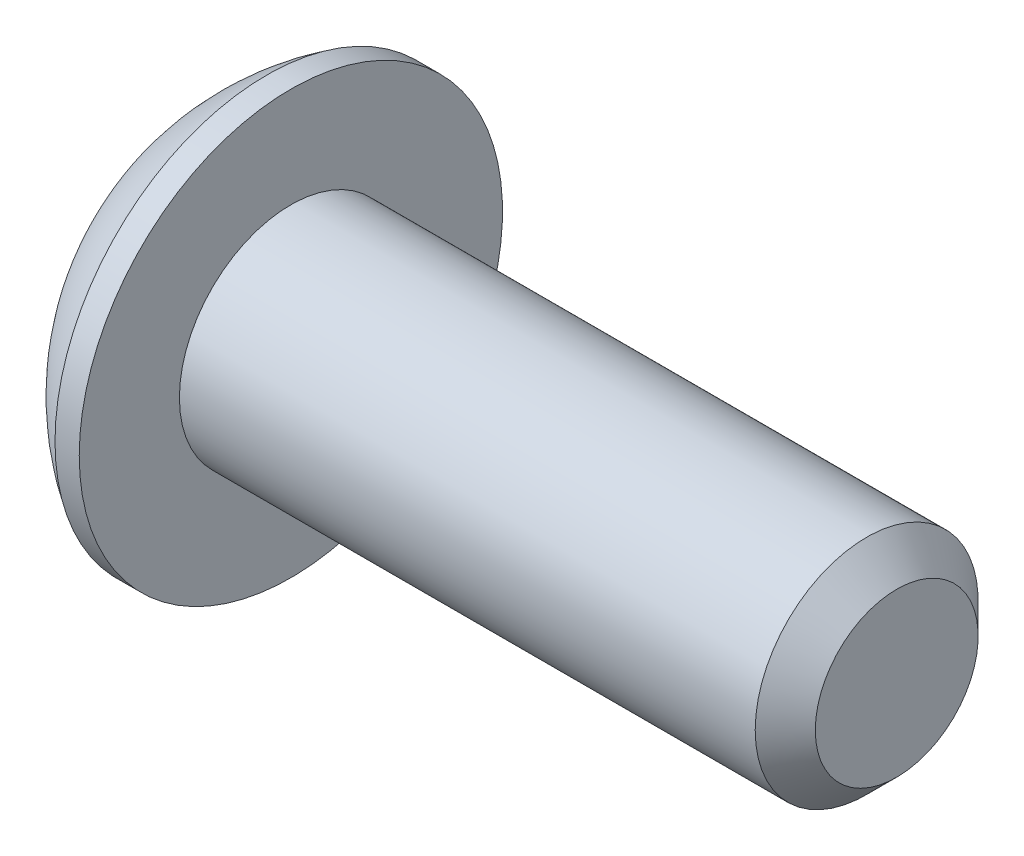
ISO-10303-21;
HEADER;
FILE_DESCRIPTION(('STEP AP214'),'2;1');
FILE_NAME('part.step','',(''),(''),'','','');
FILE_SCHEMA(('AUTOMOTIVE_DESIGN { 1 0 10303 214 1 1 1 1 }'));
ENDSEC;
DATA;
#1=APPLICATION_CONTEXT('core data for automotive mechanical design processes');
#2=APPLICATION_PROTOCOL_DEFINITION('international standard','automotive_design',2000,#1);
#3=PRODUCT_CONTEXT('',#1,'mechanical');
#4=PRODUCT('Part','Part','',(#3));
#5=PRODUCT_RELATED_PRODUCT_CATEGORY('part','',(#4));
#6=PRODUCT_DEFINITION_FORMATION('','',#4);
#7=PRODUCT_DEFINITION_CONTEXT('part definition',#1,'design');
#8=PRODUCT_DEFINITION('design','',#6,#7);
#9=PRODUCT_DEFINITION_SHAPE('','',#8);
#10=(LENGTH_UNIT() NAMED_UNIT(*) SI_UNIT(.MILLI.,.METRE.));
#11=(NAMED_UNIT(*) PLANE_ANGLE_UNIT() SI_UNIT($,.RADIAN.));
#12=(NAMED_UNIT(*) SI_UNIT($,.STERADIAN.) SOLID_ANGLE_UNIT());
#13=UNCERTAINTY_MEASURE_WITH_UNIT(LENGTH_MEASURE(1.E-05),#10,'distance_accuracy_value','');
#14=(GEOMETRIC_REPRESENTATION_CONTEXT(3) GLOBAL_UNCERTAINTY_ASSIGNED_CONTEXT((#13)) GLOBAL_UNIT_ASSIGNED_CONTEXT((#10,
#11,#12)) REPRESENTATION_CONTEXT('',''));
#15=CARTESIAN_POINT('',(0.,0.,0.));
#16=DIRECTION('',(0.,0.,1.));
#17=DIRECTION('',(1.,0.,0.));
#18=AXIS2_PLACEMENT_3D('',#15,#16,#17);
#19=CARTESIAN_POINT('',(0.,0.,0.));
#20=DIRECTION('',(-1.,0.,0.));
#21=DIRECTION('',(0.,0.,1.));
#22=AXIS2_PLACEMENT_3D('',#19,#20,#21);
#23=PLANE('',#22);
#24=CARTESIAN_POINT('',(0.,0.,0.));
#25=DIRECTION('',(-1.,0.,0.));
#26=DIRECTION('',(0.,0.,1.));
#27=AXIS2_PLACEMENT_3D('',#24,#25,#26);
#28=CIRCLE('',#27,1.6637);
#29=CARTESIAN_POINT('',(0.,0.,1.6637));
#30=VERTEX_POINT('',#29);
#31=EDGE_CURVE('E10',#30,#30,#28,.T.);
#32=ORIENTED_EDGE('',*,*,#31,.T.);
#33=EDGE_LOOP('',(#32));
#34=FACE_BOUND('',#33,.T.);
#35=DIRECTION('',(0.,1.,0.));
#36=VECTOR('',#35,1.);
#37=CARTESIAN_POINT('',(0.,0.571923176659244,-0.9906));
#38=LINE('',#37,#36);
#39=CARTESIAN_POINT('',(0.,-0.571923176659242,-0.9906));
#40=VERTEX_POINT('',#39);
#41=CARTESIAN_POINT('',(0.,0.571923176659244,-0.9906));
#42=VERTEX_POINT('',#41);
#43=EDGE_CURVE('E212',#40,#42,#38,.T.);
#44=ORIENTED_EDGE('',*,*,#43,.T.);
#45=DIRECTION('',(0.,0.5,0.866025403784439));
#46=VECTOR('',#45,1.);
#47=CARTESIAN_POINT('',(0.,1.14384635331849,0.));
#48=LINE('',#47,#46);
#49=CARTESIAN_POINT('',(0.,1.14384635331849,0.));
#50=VERTEX_POINT('',#49);
#51=EDGE_CURVE('E215',#42,#50,#48,.T.);
#52=ORIENTED_EDGE('',*,*,#51,.T.);
#53=DIRECTION('',(0.,-0.5,0.866025403784439));
#54=VECTOR('',#53,1.);
#55=CARTESIAN_POINT('',(0.,0.571923176659244,0.990600000000001));
#56=LINE('',#55,#54);
#57=CARTESIAN_POINT('',(0.,0.571923176659244,0.990600000000001));
#58=VERTEX_POINT('',#57);
#59=EDGE_CURVE('E194',#50,#58,#56,.T.);
#60=ORIENTED_EDGE('',*,*,#59,.T.);
#61=DIRECTION('',(0.,-1.,0.));
#62=VECTOR('',#61,1.);
#63=CARTESIAN_POINT('',(0.,-0.571923176659243,0.9906));
#64=LINE('',#63,#62);
#65=CARTESIAN_POINT('',(0.,-0.571923176659243,0.9906));
#66=VERTEX_POINT('',#65);
#67=EDGE_CURVE('E182',#58,#66,#64,.T.);
#68=ORIENTED_EDGE('',*,*,#67,.T.);
#69=DIRECTION('',(0.,-0.499999999999999,-0.866025403784439));
#70=VECTOR('',#69,1.);
#71=CARTESIAN_POINT('',(0.,-1.14384635331848,0.));
#72=LINE('',#71,#70);
#73=CARTESIAN_POINT('',(0.,-1.14384635331848,0.));
#74=VERTEX_POINT('',#73);
#75=EDGE_CURVE('E127',#66,#74,#72,.T.);
#76=ORIENTED_EDGE('',*,*,#75,.T.);
#77=DIRECTION('',(0.,0.499999999999999,-0.866025403784439));
#78=VECTOR('',#77,1.);
#79=CARTESIAN_POINT('',(0.,-0.571923176659242,-0.9906));
#80=LINE('',#79,#78);
#81=EDGE_CURVE('E35',#74,#40,#80,.T.);
#82=ORIENTED_EDGE('',*,*,#81,.T.);
#83=EDGE_LOOP('',(#44,#52,#60,#68,#76,#82));
#84=FACE_BOUND('',#83,.T.);
#85=ADVANCED_FACE('F16',(#34,#84),#23,.T.);
#86=CARTESIAN_POINT('',(3.55485043103449,0.,0.));
#87=DIRECTION('',(-1.,0.,0.));
#88=DIRECTION('',(0.,1.,0.));
#89=AXIS2_PLACEMENT_3D('',#86,#87,#88);
#90=SPHERICAL_SURFACE('',#89,3.92490245446);
#91=CARTESIAN_POINT('',(1.4732,0.,0.));
#92=DIRECTION('',(-1.,0.,0.));
#93=DIRECTION('',(0.,0.,1.));
#94=AXIS2_PLACEMENT_3D('',#91,#92,#93);
#95=CIRCLE('',#94,3.3274);
#96=CARTESIAN_POINT('',(1.4732,0.,3.3274));
#97=VERTEX_POINT('',#96);
#98=EDGE_CURVE('E24',#97,#97,#95,.T.);
#99=ORIENTED_EDGE('',*,*,#98,.T.);
#100=EDGE_LOOP('',(#99));
#101=FACE_BOUND('',#100,.T.);
#102=ORIENTED_EDGE('',*,*,#31,.F.);
#103=EDGE_LOOP('',(#102));
#104=FACE_BOUND('',#103,.T.);
#105=ADVANCED_FACE('F240',(#101,#104),#90,.T.);
#106=CARTESIAN_POINT('',(0.,0.,0.));
#107=DIRECTION('',(-1.,0.,0.));
#108=DIRECTION('',(0.,0.,1.));
#109=AXIS2_PLACEMENT_3D('',#106,#107,#108);
#110=CYLINDRICAL_SURFACE('',#109,3.3274);
#111=ORIENTED_EDGE('',*,*,#98,.F.);
#112=EDGE_LOOP('',(#111));
#113=FACE_BOUND('',#112,.T.);
#114=CARTESIAN_POINT('',(1.8542,0.,0.));
#115=DIRECTION('',(-1.,0.,0.));
#116=DIRECTION('',(0.,0.,1.));
#117=AXIS2_PLACEMENT_3D('',#114,#115,#116);
#118=CIRCLE('',#117,3.3274);
#119=CARTESIAN_POINT('',(1.8542,0.,3.3274));
#120=VERTEX_POINT('',#119);
#121=EDGE_CURVE('E231',#120,#120,#118,.T.);
#122=ORIENTED_EDGE('',*,*,#121,.T.);
#123=EDGE_LOOP('',(#122));
#124=FACE_BOUND('',#123,.T.);
#125=ADVANCED_FACE('F243',(#113,#124),#110,.T.);
#126=CARTESIAN_POINT('',(1.8542,1.7526,0.));
#127=DIRECTION('',(-1.,0.,0.));
#128=DIRECTION('',(0.,0.,1.));
#129=AXIS2_PLACEMENT_3D('',#126,#127,#128);
#130=PLANE('',#129);
#131=ORIENTED_EDGE('',*,*,#121,.F.);
#132=EDGE_LOOP('',(#131));
#133=FACE_BOUND('',#132,.T.);
#134=CARTESIAN_POINT('',(1.8542,0.,0.));
#135=DIRECTION('',(-1.,0.,0.));
#136=DIRECTION('',(0.,0.,1.));
#137=AXIS2_PLACEMENT_3D('',#134,#135,#136);
#138=CIRCLE('',#137,1.7526);
#139=CARTESIAN_POINT('',(1.8542,0.,1.7526));
#140=VERTEX_POINT('',#139);
#141=EDGE_CURVE('E227',#140,#140,#138,.T.);
#142=ORIENTED_EDGE('',*,*,#141,.T.);
#143=EDGE_LOOP('',(#142));
#144=FACE_BOUND('',#143,.T.);
#145=ADVANCED_FACE('F246',(#133,#144),#130,.F.);
#146=CARTESIAN_POINT('',(0.,0.,0.));
#147=DIRECTION('',(-1.,0.,0.));
#148=DIRECTION('',(0.,0.,1.));
#149=AXIS2_PLACEMENT_3D('',#146,#147,#148);
#150=CYLINDRICAL_SURFACE('',#149,1.7526);
#151=ORIENTED_EDGE('',*,*,#141,.F.);
#152=EDGE_LOOP('',(#151));
#153=FACE_BOUND('',#152,.T.);
#154=CARTESIAN_POINT('',(10.90676,0.,0.));
#155=DIRECTION('',(-1.,0.,0.));
#156=DIRECTION('',(0.,0.,1.));
#157=AXIS2_PLACEMENT_3D('',#154,#155,#156);
#158=CIRCLE('',#157,1.7526);
#159=CARTESIAN_POINT('',(10.90676,0.,1.7526));
#160=VERTEX_POINT('',#159);
#161=EDGE_CURVE('E223',#160,#160,#158,.T.);
#162=ORIENTED_EDGE('',*,*,#161,.T.);
#163=EDGE_LOOP('',(#162));
#164=FACE_BOUND('',#163,.T.);
#165=ADVANCED_FACE('F252',(#153,#164),#150,.T.);
#166=CARTESIAN_POINT('',(11.3792,0.,0.));
#167=DIRECTION('',(-1.,0.,0.));
#168=DIRECTION('',(0.,0.,1.));
#169=AXIS2_PLACEMENT_3D('',#166,#167,#168);
#170=CONICAL_SURFACE('',#169,1.28016,0.78539816339748);
#171=ORIENTED_EDGE('',*,*,#161,.F.);
#172=EDGE_LOOP('',(#171));
#173=FACE_BOUND('',#172,.T.);
#174=CARTESIAN_POINT('',(11.3792,0.,0.));
#175=DIRECTION('',(-1.,0.,0.));
#176=DIRECTION('',(0.,0.,1.));
#177=AXIS2_PLACEMENT_3D('',#174,#175,#176);
#178=CIRCLE('',#177,1.28016);
#179=CARTESIAN_POINT('',(11.3792,0.,1.28016));
#180=VERTEX_POINT('',#179);
#181=EDGE_CURVE('E219',#180,#180,#178,.T.);
#182=ORIENTED_EDGE('',*,*,#181,.T.);
#183=EDGE_LOOP('',(#182));
#184=FACE_BOUND('',#183,.T.);
#185=ADVANCED_FACE('F258',(#173,#184),#170,.T.);
#186=CARTESIAN_POINT('',(11.3792,0.,0.));
#187=DIRECTION('',(-1.,0.,0.));
#188=DIRECTION('',(0.,0.,1.));
#189=AXIS2_PLACEMENT_3D('',#186,#187,#188);
#190=PLANE('',#189);
#191=ORIENTED_EDGE('',*,*,#181,.F.);
#192=EDGE_LOOP('',(#191));
#193=FACE_BOUND('',#192,.T.);
#194=ADVANCED_FACE('F264',(#193),#190,.F.);
#195=CARTESIAN_POINT('',(1.1176,1.14384635331849,0.));
#196=DIRECTION('',(0.,-0.866025403784439,0.5));
#197=DIRECTION('',(0.,-0.5,-0.866025403784439));
#198=AXIS2_PLACEMENT_3D('',#195,#196,#197);
#199=PLANE('',#198);
#200=DIRECTION('',(0.,0.5,0.866025403784439));
#201=VECTOR('',#200,1.);
#202=CARTESIAN_POINT('',(1.1176,1.14384635331849,0.));
#203=LINE('',#202,#201);
#204=CARTESIAN_POINT('',(1.1176,0.571923176659244,-0.9906));
#205=VERTEX_POINT('',#204);
#206=CARTESIAN_POINT('',(1.1176,0.857884764988866,-0.495300000000001));
#207=VERTEX_POINT('',#206);
#208=EDGE_CURVE('E205',#205,#207,#203,.T.);
#209=ORIENTED_EDGE('',*,*,#208,.T.);
#210=CARTESIAN_POINT('',(1.1176,1.14384635331849,0.));
#211=VERTEX_POINT('',#210);
#212=EDGE_CURVE('E201',#207,#211,#203,.T.);
#213=ORIENTED_EDGE('',*,*,#212,.T.);
#214=DIRECTION('',(-1.,0.,0.));
#215=VECTOR('',#214,1.);
#216=CARTESIAN_POINT('',(1.1176,1.14384635331849,0.));
#217=LINE('',#216,#215);
#218=EDGE_CURVE('E197',#211,#50,#217,.T.);
#219=ORIENTED_EDGE('',*,*,#218,.T.);
#220=ORIENTED_EDGE('',*,*,#51,.F.);
#221=DIRECTION('',(-1.,0.,0.));
#222=VECTOR('',#221,1.);
#223=CARTESIAN_POINT('',(1.1176,0.571923176659244,-0.9906));
#224=LINE('',#223,#222);
#225=EDGE_CURVE('E47',#205,#42,#224,.T.);
#226=ORIENTED_EDGE('',*,*,#225,.F.);
#227=EDGE_LOOP('',(#209,#213,#219,#220,#226));
#228=FACE_BOUND('',#227,.T.);
#229=ADVANCED_FACE('F269',(#228),#199,.T.);
#230=CARTESIAN_POINT('',(1.1176,0.571923176659244,-0.9906));
#231=DIRECTION('',(0.,0.,1.));
#232=DIRECTION('',(1.,0.,0.));
#233=AXIS2_PLACEMENT_3D('',#230,#231,#232);
#234=PLANE('',#233);
#235=DIRECTION('',(0.,1.,0.));
#236=VECTOR('',#235,1.);
#237=CARTESIAN_POINT('',(1.1176,0.571923176659244,-0.9906));
#238=LINE('',#237,#236);
#239=CARTESIAN_POINT('',(1.1176,-0.571923176659242,-0.9906));
#240=VERTEX_POINT('',#239);
#241=CARTESIAN_POINT('',(1.1176,0.,-0.9906));
#242=VERTEX_POINT('',#241);
#243=EDGE_CURVE('E209',#240,#242,#238,.T.);
#244=ORIENTED_EDGE('',*,*,#243,.T.);
#245=EDGE_CURVE('E206',#242,#205,#238,.T.);
#246=ORIENTED_EDGE('',*,*,#245,.T.);
#247=ORIENTED_EDGE('',*,*,#225,.T.);
#248=ORIENTED_EDGE('',*,*,#43,.F.);
#249=DIRECTION('',(-1.,0.,0.));
#250=VECTOR('',#249,1.);
#251=CARTESIAN_POINT('',(1.1176,-0.571923176659242,-0.9906));
#252=LINE('',#251,#250);
#253=EDGE_CURVE('E171',#240,#40,#252,.T.);
#254=ORIENTED_EDGE('',*,*,#253,.F.);
#255=EDGE_LOOP('',(#244,#246,#247,#248,#254));
#256=FACE_BOUND('',#255,.T.);
#257=ADVANCED_FACE('F275',(#256),#234,.T.);
#258=CARTESIAN_POINT('',(1.1176,-1.71576952997773,-0.9906));
#259=DIRECTION('',(1.,0.,0.));
#260=DIRECTION('',(0.,0.,-1.));
#261=AXIS2_PLACEMENT_3D('',#258,#259,#260);
#262=PLANE('',#261);
#263=CARTESIAN_POINT('',(1.1176,0.,0.));
#264=DIRECTION('',(-1.,0.,0.));
#265=DIRECTION('',(0.,0.,1.));
#266=AXIS2_PLACEMENT_3D('',#263,#264,#265);
#267=CIRCLE('',#266,0.9906);
#268=CARTESIAN_POINT('',(1.1176,-0.857884764988865,-0.495299999999999));
#269=VERTEX_POINT('',#268);
#270=EDGE_CURVE('E145',#242,#269,#267,.T.);
#271=ORIENTED_EDGE('',*,*,#270,.F.);
#272=ORIENTED_EDGE('',*,*,#243,.F.);
#273=DIRECTION('',(0.,0.499999999999999,-0.866025403784439));
#274=VECTOR('',#273,1.);
#275=CARTESIAN_POINT('',(1.1176,-0.571923176659242,-0.9906));
#276=LINE('',#275,#274);
#277=EDGE_CURVE('E156',#269,#240,#276,.T.);
#278=ORIENTED_EDGE('',*,*,#277,.F.);
#279=EDGE_LOOP('',(#271,#272,#278));
#280=FACE_BOUND('',#279,.T.);
#281=ADVANCED_FACE('F289',(#280),#262,.F.);
#282=EDGE_CURVE('E170',#207,#242,#267,.T.);
#283=ORIENTED_EDGE('',*,*,#282,.F.);
#284=ORIENTED_EDGE('',*,*,#208,.F.);
#285=ORIENTED_EDGE('',*,*,#245,.F.);
#286=EDGE_LOOP('',(#283,#284,#285));
#287=FACE_BOUND('',#286,.T.);
#288=ADVANCED_FACE('F371',(#287),#262,.F.);
#289=CARTESIAN_POINT('',(1.1176,0.857884764988866,0.495300000000001));
#290=VERTEX_POINT('',#289);
#291=EDGE_CURVE('E163',#290,#207,#267,.T.);
#292=ORIENTED_EDGE('',*,*,#291,.F.);
#293=DIRECTION('',(0.,-0.5,0.866025403784439));
#294=VECTOR('',#293,1.);
#295=CARTESIAN_POINT('',(1.1176,0.571923176659244,0.990600000000001));
#296=LINE('',#295,#294);
#297=EDGE_CURVE('E193',#211,#290,#296,.T.);
#298=ORIENTED_EDGE('',*,*,#297,.F.);
#299=ORIENTED_EDGE('',*,*,#212,.F.);
#300=EDGE_LOOP('',(#292,#298,#299));
#301=FACE_BOUND('',#300,.T.);
#302=ADVANCED_FACE('F368',(#301),#262,.F.);
#303=CARTESIAN_POINT('',(1.1176,0.571923176659244,0.990600000000001));
#304=DIRECTION('',(0.,-0.866025403784439,-0.5));
#305=DIRECTION('',(0.,0.5,-0.866025403784439));
#306=AXIS2_PLACEMENT_3D('',#303,#304,#305);
#307=PLANE('',#306);
#308=ORIENTED_EDGE('',*,*,#297,.T.);
#309=CARTESIAN_POINT('',(1.1176,0.571923176659244,0.990600000000001));
#310=VERTEX_POINT('',#309);
#311=EDGE_CURVE('E190',#290,#310,#296,.T.);
#312=ORIENTED_EDGE('',*,*,#311,.T.);
#313=DIRECTION('',(-1.,0.,0.));
#314=VECTOR('',#313,1.);
#315=CARTESIAN_POINT('',(1.1176,0.571923176659244,0.990600000000001));
#316=LINE('',#315,#314);
#317=EDGE_CURVE('E186',#310,#58,#316,.T.);
#318=ORIENTED_EDGE('',*,*,#317,.T.);
#319=ORIENTED_EDGE('',*,*,#59,.F.);
#320=ORIENTED_EDGE('',*,*,#218,.F.);
#321=EDGE_LOOP('',(#308,#312,#318,#319,#320));
#322=FACE_BOUND('',#321,.T.);
#323=ADVANCED_FACE('F365',(#322),#307,.T.);
#324=CARTESIAN_POINT('',(1.1176,0.,0.9906));
#325=VERTEX_POINT('',#324);
#326=EDGE_CURVE('E151',#325,#290,#267,.T.);
#327=ORIENTED_EDGE('',*,*,#326,.F.);
#328=DIRECTION('',(0.,-1.,0.));
#329=VECTOR('',#328,1.);
#330=CARTESIAN_POINT('',(1.1176,-0.571923176659243,0.9906));
#331=LINE('',#330,#329);
#332=EDGE_CURVE('E160',#310,#325,#331,.T.);
#333=ORIENTED_EDGE('',*,*,#332,.F.);
#334=ORIENTED_EDGE('',*,*,#311,.F.);
#335=EDGE_LOOP('',(#327,#333,#334));
#336=FACE_BOUND('',#335,.T.);
#337=ADVANCED_FACE('F362',(#336),#262,.F.);
#338=CARTESIAN_POINT('',(1.1176,-0.571923176659243,0.9906));
#339=DIRECTION('',(0.,0.,-1.));
#340=DIRECTION('',(0.,1.,0.));
#341=AXIS2_PLACEMENT_3D('',#338,#339,#340);
#342=PLANE('',#341);
#343=ORIENTED_EDGE('',*,*,#332,.T.);
#344=CARTESIAN_POINT('',(1.1176,-0.571923176659243,0.9906));
#345=VERTEX_POINT('',#344);
#346=EDGE_CURVE('E140',#325,#345,#331,.T.);
#347=ORIENTED_EDGE('',*,*,#346,.T.);
#348=DIRECTION('',(-1.,0.,0.));
#349=VECTOR('',#348,1.);
#350=CARTESIAN_POINT('',(1.1176,-0.571923176659243,0.9906));
#351=LINE('',#350,#349);
#352=EDGE_CURVE('E121',#345,#66,#351,.T.);
#353=ORIENTED_EDGE('',*,*,#352,.T.);
#354=ORIENTED_EDGE('',*,*,#67,.F.);
#355=ORIENTED_EDGE('',*,*,#317,.F.);
#356=EDGE_LOOP('',(#343,#347,#353,#354,#355));
#357=FACE_BOUND('',#356,.T.);
#358=ADVANCED_FACE('F358',(#357),#342,.T.);
#359=CARTESIAN_POINT('',(1.68952317665925,0.,0.));
#360=DIRECTION('',(-1.,0.,0.));
#361=DIRECTION('',(0.,0.,1.));
#362=AXIS2_PLACEMENT_3D('',#359,#360,#361);
#363=CONICAL_SURFACE('',#362,0.,1.04719755119659);
#364=ORIENTED_EDGE('',*,*,#326,.T.);
#365=ORIENTED_EDGE('',*,*,#291,.T.);
#366=ORIENTED_EDGE('',*,*,#282,.T.);
#367=ORIENTED_EDGE('',*,*,#270,.T.);
#368=CARTESIAN_POINT('',(1.1176,-0.857884764988864,0.495299999999998));
#369=VERTEX_POINT('',#368);
#370=EDGE_CURVE('E133',#269,#369,#267,.T.);
#371=ORIENTED_EDGE('',*,*,#370,.T.);
#372=EDGE_CURVE('E138',#369,#325,#267,.T.);
#373=ORIENTED_EDGE('',*,*,#372,.T.);
#374=EDGE_LOOP('',(#364,#365,#366,#367,#371,#373));
#375=FACE_BOUND('',#374,.T.);
#376=CARTESIAN_POINT('',(1.68952317665925,0.,0.));
#377=VERTEX_POINT('',#376);
#378=VERTEX_LOOP('',#377);
#379=FACE_BOUND('',#378,.T.);
#380=ADVANCED_FACE('F147',(#375,#379),#363,.F.);
#381=CARTESIAN_POINT('',(1.1176,-0.571923176659242,-0.9906));
#382=DIRECTION('',(0.,0.866025403784439,0.499999999999999));
#383=DIRECTION('',(0.,-0.499999999999999,0.866025403784439));
#384=AXIS2_PLACEMENT_3D('',#381,#382,#383);
#385=PLANE('',#384);
#386=CARTESIAN_POINT('',(1.1176,-1.14384635331848,0.));
#387=VERTEX_POINT('',#386);
#388=EDGE_CURVE('E135',#387,#269,#276,.T.);
#389=ORIENTED_EDGE('',*,*,#388,.T.);
#390=ORIENTED_EDGE('',*,*,#277,.T.);
#391=ORIENTED_EDGE('',*,*,#253,.T.);
#392=ORIENTED_EDGE('',*,*,#81,.F.);
#393=DIRECTION('',(-1.,0.,0.));
#394=VECTOR('',#393,1.);
#395=CARTESIAN_POINT('',(1.1176,-1.14384635331848,0.));
#396=LINE('',#395,#394);
#397=EDGE_CURVE('E137',#387,#74,#396,.T.);
#398=ORIENTED_EDGE('',*,*,#397,.F.);
#399=EDGE_LOOP('',(#389,#390,#391,#392,#398));
#400=FACE_BOUND('',#399,.T.);
#401=ADVANCED_FACE('F381',(#400),#385,.T.);
#402=ORIENTED_EDGE('',*,*,#370,.F.);
#403=ORIENTED_EDGE('',*,*,#388,.F.);
#404=DIRECTION('',(0.,-0.499999999999999,-0.866025403784439));
#405=VECTOR('',#404,1.);
#406=CARTESIAN_POINT('',(1.1176,-1.14384635331848,0.));
#407=LINE('',#406,#405);
#408=EDGE_CURVE('E119',#369,#387,#407,.T.);
#409=ORIENTED_EDGE('',*,*,#408,.F.);
#410=EDGE_LOOP('',(#402,#403,#409));
#411=FACE_BOUND('',#410,.T.);
#412=ADVANCED_FACE('F131',(#411),#262,.F.);
#413=ORIENTED_EDGE('',*,*,#372,.F.);
#414=EDGE_CURVE('E116',#345,#369,#407,.T.);
#415=ORIENTED_EDGE('',*,*,#414,.F.);
#416=ORIENTED_EDGE('',*,*,#346,.F.);
#417=EDGE_LOOP('',(#413,#415,#416));
#418=FACE_BOUND('',#417,.T.);
#419=ADVANCED_FACE('F139',(#418),#262,.F.);
#420=CARTESIAN_POINT('',(1.1176,-1.14384635331848,0.));
#421=DIRECTION('',(0.,0.866025403784439,-0.499999999999999));
#422=DIRECTION('',(0.,0.499999999999999,0.866025403784439));
#423=AXIS2_PLACEMENT_3D('',#420,#421,#422);
#424=PLANE('',#423);
#425=ORIENTED_EDGE('',*,*,#414,.T.);
#426=ORIENTED_EDGE('',*,*,#408,.T.);
#427=ORIENTED_EDGE('',*,*,#397,.T.);
#428=ORIENTED_EDGE('',*,*,#75,.F.);
#429=ORIENTED_EDGE('',*,*,#352,.F.);
#430=EDGE_LOOP('',(#425,#426,#427,#428,#429));
#431=FACE_BOUND('',#430,.T.);
#432=ADVANCED_FACE('F118',(#431),#424,.T.);
#433=CLOSED_SHELL('',(#85,#105,#125,#145,#165,#185,#194,#229,#257,#281,#288,#302,#323,#337,#358,
#380,#401,#412,#419,#432));
#434=MANIFOLD_SOLID_BREP('B1',#433);
#435=ADVANCED_BREP_SHAPE_REPRESENTATION('',(#18,#434),#14);
#436=SHAPE_DEFINITION_REPRESENTATION(#9,#435);
ENDSEC;
END-ISO-10303-21;
